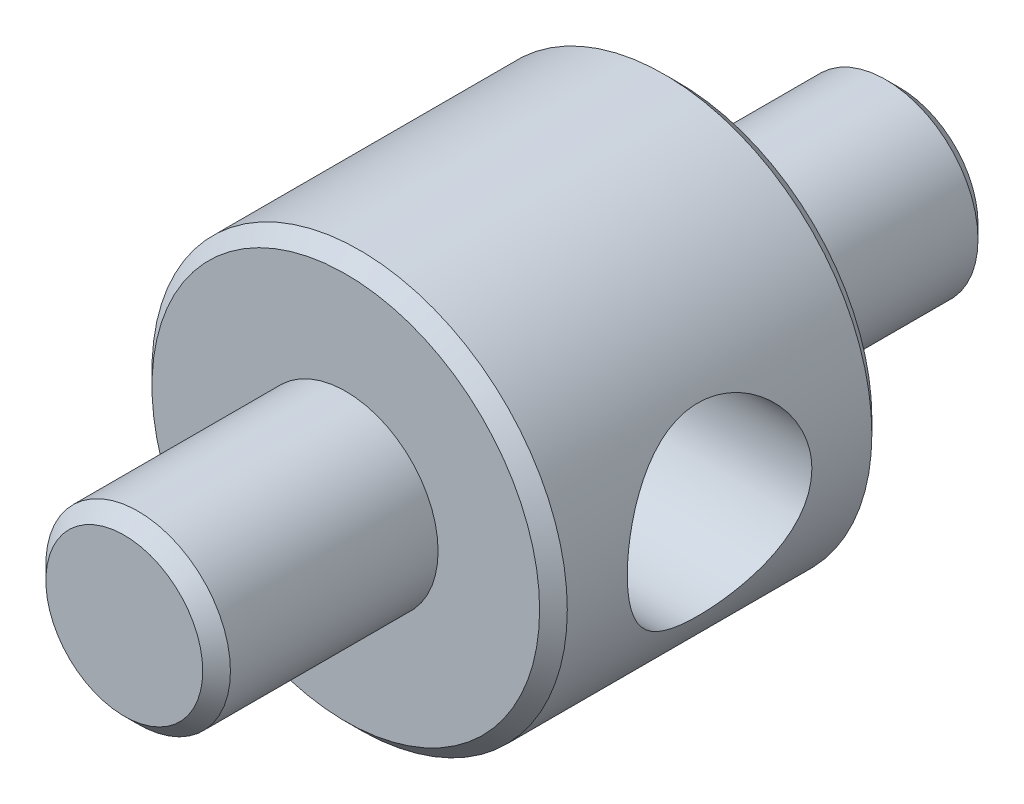
ISO-10303-21;
HEADER;
FILE_DESCRIPTION(('STEP AP214'),'2;1');
FILE_NAME('part.step','',(''),(''),'','','');
FILE_SCHEMA(('AUTOMOTIVE_DESIGN { 1 0 10303 214 1 1 1 1 }'));
ENDSEC;
DATA;
#1=APPLICATION_CONTEXT('core data for automotive mechanical design processes');
#2=APPLICATION_PROTOCOL_DEFINITION('international standard','automotive_design',2000,#1);
#3=PRODUCT_CONTEXT('',#1,'mechanical');
#4=PRODUCT('Part','Part','',(#3));
#5=PRODUCT_RELATED_PRODUCT_CATEGORY('part','',(#4));
#6=PRODUCT_DEFINITION_FORMATION('','',#4);
#7=PRODUCT_DEFINITION_CONTEXT('part definition',#1,'design');
#8=PRODUCT_DEFINITION('design','',#6,#7);
#9=PRODUCT_DEFINITION_SHAPE('','',#8);
#10=(LENGTH_UNIT() NAMED_UNIT(*) SI_UNIT(.MILLI.,.METRE.));
#11=(NAMED_UNIT(*) PLANE_ANGLE_UNIT() SI_UNIT($,.RADIAN.));
#12=(NAMED_UNIT(*) SI_UNIT($,.STERADIAN.) SOLID_ANGLE_UNIT());
#13=UNCERTAINTY_MEASURE_WITH_UNIT(LENGTH_MEASURE(1.E-05),#10,'distance_accuracy_value','');
#14=(GEOMETRIC_REPRESENTATION_CONTEXT(3) GLOBAL_UNCERTAINTY_ASSIGNED_CONTEXT((#13)) GLOBAL_UNIT_ASSIGNED_CONTEXT((#10,
#11,#12)) REPRESENTATION_CONTEXT('',''));
#15=CARTESIAN_POINT('',(0.,0.,0.));
#16=DIRECTION('',(0.,0.,1.));
#17=DIRECTION('',(1.,0.,0.));
#18=AXIS2_PLACEMENT_3D('',#15,#16,#17);
#19=CARTESIAN_POINT('',(0.,0.,18.));
#20=DIRECTION('',(0.,0.,-1.));
#21=DIRECTION('',(-1.,0.,0.));
#22=AXIS2_PLACEMENT_3D('',#19,#20,#21);
#23=CYLINDRICAL_SURFACE('',#22,22.5);
#24=CARTESIAN_POINT('',(-22.5,0.,-10.));
#25=CARTESIAN_POINT('',(-22.4999983412741,0.266358674506629,-9.99999801489142));
#26=CARTESIAN_POINT('',(-22.4952577550859,0.532785210886051,-9.98934407429766));
#27=CARTESIAN_POINT('',(-22.4764129887687,1.06372052827526,-9.94683332964316));
#28=CARTESIAN_POINT('',(-22.4623034599646,1.3282281265239,-9.91496441404969));
#29=CARTESIAN_POINT('',(-22.4250533191297,1.85378409880719,-9.83028307683902));
#30=CARTESIAN_POINT('',(-22.4018943007243,2.11482429416228,-9.77742796641402));
#31=CARTESIAN_POINT('',(-22.3471481148333,2.63103736565179,-9.65133414309113));
#32=CARTESIAN_POINT('',(-22.3155603486292,2.88620982358468,-9.57809398216803));
#33=CARTESIAN_POINT('',(-22.2448892220841,3.38804988474801,-9.41226320369187));
#34=CARTESIAN_POINT('',(-22.2058338172876,3.63474528214795,-9.31974464349954));
#35=CARTESIAN_POINT('',(-22.1211070120447,4.11911290035001,-9.11602719514624));
#36=CARTESIAN_POINT('',(-22.0754354056065,4.35678483992094,-9.00482772534838));
#37=CARTESIAN_POINT('',(-21.9785761888309,4.82167159326358,-8.76469499017571));
#38=CARTESIAN_POINT('',(-21.9273913187015,5.04889152249531,-8.63577052576966));
#39=CARTESIAN_POINT('',(-21.8206650853107,5.49186561087359,-8.36106562417567));
#40=CARTESIAN_POINT('',(-21.7651221240651,5.70761551519558,-8.21527899474929));
#41=CARTESIAN_POINT('',(-21.5880568498737,6.35714242369687,-7.73850030503356));
#42=CARTESIAN_POINT('',(-21.4611409325697,6.76979822740147,-7.38012792068984));
#43=CARTESIAN_POINT('',(-21.2058946147112,7.53139326958645,-6.60114247843569));
#44=CARTESIAN_POINT('',(-21.0775634189794,7.88029452728651,-6.18049258800698));
#45=CARTESIAN_POINT('',(-20.8904888985783,8.35877756226238,-5.49676219265885));
#46=CARTESIAN_POINT('',(-20.8274141488895,8.51431075280241,-5.25266913044278));
#47=CARTESIAN_POINT('',(-20.706580039709,8.80409930019552,-4.75096387485483));
#48=CARTESIAN_POINT('',(-20.6488184651489,8.93836354110986,-4.4933573862268));
#49=CARTESIAN_POINT('',(-20.5405571154436,9.184421545613,-3.96623247962893));
#50=CARTESIAN_POINT('',(-20.4900557283934,9.29622029918278,-3.69671672317797));
#51=CARTESIAN_POINT('',(-20.3981349149272,9.49622142398353,-3.14756074684072));
#52=CARTESIAN_POINT('',(-20.3567147069907,9.58442582587336,-2.86792140059931));
#53=CARTESIAN_POINT('',(-20.2864713022003,9.73218489954871,-2.3155897322206));
#54=CARTESIAN_POINT('',(-20.2571004246296,9.79300174905989,-2.04330481322032));
#55=CARTESIAN_POINT('',(-20.2090612627247,9.89175779481313,-1.4936771914048));
#56=CARTESIAN_POINT('',(-20.1903926080827,9.92969778262004,-1.21633466393058));
#57=CARTESIAN_POINT('',(-20.1644973394177,9.98217951008383,-0.659070013584596));
#58=CARTESIAN_POINT('',(-20.1572641728748,9.99673464930624,-0.37914946047934));
#59=CARTESIAN_POINT('',(-20.1545116933501,10.0022834901155,0.180974132128588));
#60=CARTESIAN_POINT('',(-20.1589916277639,9.993278705503,0.461177152325461));
#61=CARTESIAN_POINT('',(-20.178556996954,9.95370553775353,0.994311539194443));
#62=CARTESIAN_POINT('',(-20.1926536074241,9.92514683895553,1.24743167715935));
#63=CARTESIAN_POINT('',(-20.2299357176033,9.84893398121707,1.75018866603186));
#64=CARTESIAN_POINT('',(-20.2531243076265,9.80127332950511,1.99982430266817));
#65=CARTESIAN_POINT('',(-20.3078519348151,9.68736967775726,2.49381495021869));
#66=CARTESIAN_POINT('',(-20.3393891895847,9.62113064392871,2.73817107625066));
#67=CARTESIAN_POINT('',(-20.4098821228145,9.47067093458348,3.22027775721418));
#68=CARTESIAN_POINT('',(-20.4488407242047,9.38644317253835,3.45802566705101));
#69=CARTESIAN_POINT('',(-20.5339927684761,9.19869507343533,3.93065940340294));
#70=CARTESIAN_POINT('',(-20.5803264052518,9.09479139530678,4.16536747547223));
#71=CARTESIAN_POINT('',(-20.6783222006865,8.86972683399475,4.62531422771477));
#72=CARTESIAN_POINT('',(-20.7299866437201,8.74855854398004,4.85054878958468));
#73=CARTESIAN_POINT('',(-20.8372968943357,8.48979808494964,5.29041076733051));
#74=CARTESIAN_POINT('',(-20.8929431658974,8.35220400067697,5.50503694212868));
#75=CARTESIAN_POINT('',(-21.0068589492686,8.06140567885882,5.9227107488607));
#76=CARTESIAN_POINT('',(-21.0651286283891,7.90820044490401,6.12575764043459));
#77=CARTESIAN_POINT('',(-21.1887005762833,7.57127612315421,6.53861837350061));
#78=CARTESIAN_POINT('',(-21.254133812688,7.38603823151229,6.74715584420609));
#79=CARTESIAN_POINT('',(-21.3847641683632,6.99882808584691,7.14800953933823));
#80=CARTESIAN_POINT('',(-21.4499613534205,6.79686094083625,7.34033068019162));
#81=CARTESIAN_POINT('',(-21.5784874997096,6.37707504510995,7.70783899814699));
#82=CARTESIAN_POINT('',(-21.6418151491746,6.15924551934532,7.88301433543272));
#83=CARTESIAN_POINT('',(-21.7648901464863,5.709113060899,8.21487573203865));
#84=CARTESIAN_POINT('',(-21.8246389222671,5.47681597710945,8.37156918995315));
#85=CARTESIAN_POINT('',(-21.9407342792391,4.99181150591135,8.66978956457849));
#86=CARTESIAN_POINT('',(-21.9969259705791,4.73870176201838,8.81072380191943));
#87=CARTESIAN_POINT('',(-22.1022977955686,4.22000703014157,9.07059429202969));
#88=CARTESIAN_POINT('',(-22.1514777078841,3.95442164870328,9.18952985042368));
#89=CARTESIAN_POINT('',(-22.2413648148402,3.41277136658874,9.40413754279795));
#90=CARTESIAN_POINT('',(-22.2820763099849,3.13671186960291,9.49982148878462));
#91=CARTESIAN_POINT('',(-22.3538236970007,2.57611847726868,9.66690930787201));
#92=CARTESIAN_POINT('',(-22.3848604401935,2.2915853299672,9.73831531733953));
#93=CARTESIAN_POINT('',(-22.4344936419773,1.73655379186009,9.85184842232812));
#94=CARTESIAN_POINT('',(-22.4538085491568,1.46646625264617,9.89567445854468));
#95=CARTESIAN_POINT('',(-22.4827022481691,0.923093824753187,9.96106249991966));
#96=CARTESIAN_POINT('',(-22.492281491961,0.649809085093726,9.98262553859495));
#97=CARTESIAN_POINT('',(-22.5014327813663,0.102305199893459,10.0032275607149));
#98=CARTESIAN_POINT('',(-22.5010077394445,-0.171913650464062,10.0022730994924));
#99=CARTESIAN_POINT('',(-22.4901693364661,-0.719144891104904,9.97786740741689));
#100=CARTESIAN_POINT('',(-22.4797562573607,-0.992157315225745,9.95441681160476));
#101=CARTESIAN_POINT('',(-22.4501266532091,-1.5189915807864,9.88731655373121));
#102=CARTESIAN_POINT('',(-22.4314577903456,-1.77300551778789,9.84492197887201));
#103=CARTESIAN_POINT('',(-22.3859845778249,-2.2762980737003,9.74086726803527));
#104=CARTESIAN_POINT('',(-22.3591806218089,-2.52557692111295,9.6792080642313));
#105=CARTESIAN_POINT('',(-22.2980830127615,-3.0177798863728,9.53722228352212));
#106=CARTESIAN_POINT('',(-22.2637901456724,-3.26070466806966,9.45689766544831));
#107=CARTESIAN_POINT('',(-22.1884984795923,-3.7388693183974,9.27825549703403));
#108=CARTESIAN_POINT('',(-22.1474971105102,-3.97410620011853,9.17993104906421));
#109=CARTESIAN_POINT('',(-22.0583710838479,-4.4426193877379,8.96280280783393));
#110=CARTESIAN_POINT('',(-22.010065898814,-4.67561206078989,8.84346144460099));
#111=CARTESIAN_POINT('',(-21.908433598371,-5.13078390971223,8.58739045891613));
#112=CARTESIAN_POINT('',(-21.8551047719357,-5.35295936192739,8.4506549064971));
#113=CARTESIAN_POINT('',(-21.744642321343,-5.78535529571012,8.160725126261));
#114=CARTESIAN_POINT('',(-21.6875079761197,-5.99557349755944,8.00752777588658));
#115=CARTESIAN_POINT('',(-21.5707242991031,-6.40302886015366,7.68561275034613));
#116=CARTESIAN_POINT('',(-21.5110748459504,-6.60026539332612,7.51689432578923));
#117=CARTESIAN_POINT('',(-21.38572348661,-6.99623977160872,7.1506032700088));
#118=CARTESIAN_POINT('',(-21.3199221098287,-7.19381006998432,6.95180065996954));
#119=CARTESIAN_POINT('',(-21.1887052352925,-7.57157516822001,6.5383216067555));
#120=CARTESIAN_POINT('',(-21.1232896306177,-7.7517750176108,6.32364980895648));
#121=CARTESIAN_POINT('',(-20.9945797859484,-8.09388924179568,5.87942046829087));
#122=CARTESIAN_POINT('',(-20.9312865688396,-8.25579488629138,5.64985589991669));
#123=CARTESIAN_POINT('',(-20.8086644919195,-8.56016436228012,5.1771249604688));
#124=CARTESIAN_POINT('',(-20.7493361215173,-8.70262579589177,4.93395691700349));
#125=CARTESIAN_POINT('',(-20.6351213631842,-8.97014113507602,4.42944810766799));
#126=CARTESIAN_POINT('',(-20.5803743435446,-9.09469990199382,4.16781253194244));
#127=CARTESIAN_POINT('',(-20.4788579023647,-9.32103921932125,3.63350483395783));
#128=CARTESIAN_POINT('',(-20.4320847381341,-9.42283046316672,3.36083796423342));
#129=CARTESIAN_POINT('',(-20.3482468504859,-9.6025356438913,2.80645029954083));
#130=CARTESIAN_POINT('',(-20.3111766052706,-9.68046316559654,2.52473475698673));
#131=CARTESIAN_POINT('',(-20.2481926425272,-9.81152406599923,1.95437606654269));
#132=CARTESIAN_POINT('',(-20.222277664546,-9.86466024597034,1.66573370521908));
#133=CARTESIAN_POINT('',(-20.1843698111919,-9.94197643772676,1.10875008770604));
#134=CARTESIAN_POINT('',(-20.1713827745655,-9.96822966613534,0.840762703794265));
#135=CARTESIAN_POINT('',(-20.1561357409042,-9.99902478688881,0.303243244528133));
#136=CARTESIAN_POINT('',(-20.1538751110936,-10.0035679599608,0.0337112612325171));
#137=CARTESIAN_POINT('',(-20.1601645139545,-9.99088649900075,-0.5046580617197));
#138=CARTESIAN_POINT('',(-20.1687125217854,-9.9736659420863,-0.77349552203207));
#139=CARTESIAN_POINT('',(-20.196298945699,-9.91768517459673,-1.30836680601087));
#140=CARTESIAN_POINT('',(-20.2153371976009,-9.87892530112927,-1.57440067348938));
#141=CARTESIAN_POINT('',(-20.2617654840576,-9.78332716332782,-2.08566618198654));
#142=CARTESIAN_POINT('',(-20.2885807362236,-9.72772411668519,-2.33118280512387));
#143=CARTESIAN_POINT('',(-20.3500529208607,-9.59846160365254,-2.81649099138035));
#144=CARTESIAN_POINT('',(-20.3847125269139,-9.52479598029974,-3.05628057168104));
#145=CARTESIAN_POINT('',(-20.4608673563323,-9.36008167510315,-3.5286564779378));
#146=CARTESIAN_POINT('',(-20.5023616087251,-9.26903546216244,-3.76124382152048));
#147=CARTESIAN_POINT('',(-20.5910654560539,-9.07027346894596,-4.21808873074838));
#148=CARTESIAN_POINT('',(-20.6382771405329,-8.96255159020798,-4.44234321162513));
#149=CARTESIAN_POINT('',(-20.7930068459953,-8.60073036887333,-5.12891739777555));
#150=CARTESIAN_POINT('',(-20.9085624707511,-8.31840632323343,-5.5749207966406));
#151=CARTESIAN_POINT('',(-21.1482560424409,-7.68859265364666,-6.41574156812343));
#152=CARTESIAN_POINT('',(-21.2723975603181,-7.34107581132982,-6.8105374444338));
#153=CARTESIAN_POINT('',(-21.4615623012626,-6.7600210241619,-7.3745266720704));
#154=CARTESIAN_POINT('',(-21.5277465050087,-6.54670794344012,-7.56454357057132));
#155=CARTESIAN_POINT('',(-21.6573931597522,-6.10413045502065,-7.92597894664918));
#156=CARTESIAN_POINT('',(-21.7208564657984,-5.87487111875031,-8.09740329327397));
#157=CARTESIAN_POINT('',(-21.8433853752714,-5.40151273688932,-8.42056169047814));
#158=CARTESIAN_POINT('',(-21.9024477771704,-5.15740311817856,-8.57228146504076));
#159=CARTESIAN_POINT('',(-22.0144954122653,-4.65596026548334,-8.85464881838047));
#160=CARTESIAN_POINT('',(-22.0674811108367,-4.39862804632113,-8.98529801112928));
#161=CARTESIAN_POINT('',(-22.165327949851,-3.87534389039682,-9.22298029266647));
#162=CARTESIAN_POINT('',(-22.2102730712236,-3.60952001311623,-9.33026039701744));
#163=CARTESIAN_POINT('',(-22.2914633569308,-3.06846283264102,-9.52191574041082));
#164=CARTESIAN_POINT('',(-22.3277094716136,-2.79323056105034,-9.60629348162026));
#165=CARTESIAN_POINT('',(-22.3903507155281,-2.2361922261831,-9.75100247944083));
#166=CARTESIAN_POINT('',(-22.4167711762197,-1.95440508544985,-9.8113955983707));
#167=CARTESIAN_POINT('',(-22.4590737483085,-1.38603537042841,-9.90766770763661));
#168=CARTESIAN_POINT('',(-22.4749631808528,-1.09945626989597,-9.94356372881673));
#169=CARTESIAN_POINT('',(-22.4902249032581,-0.676807281399009,-9.97799030752754));
#170=CARTESIAN_POINT('',(-22.4938876174314,-0.541611708159812,-9.98624069441342));
#171=CARTESIAN_POINT('',(-22.4987756018156,-0.270949944583042,-9.99724607743069));
#172=CARTESIAN_POINT('',(-22.5000008437135,-0.135483751120323,-10.0000010097285));
#173=CARTESIAN_POINT('',(-22.5,0.,-10.));
#174=B_SPLINE_CURVE_WITH_KNOTS('',3,(#24,#25,#26,#27,#28,#29,#30,#31,#32,#33,#34,#35,#36,#37,
#38,#39,#40,#41,#42,#43,#44,#45,#46,#47,#48,#49,#50,#51,#52,#53,#54,#55,#56,#57,#58,#59,#60,#61,
#62,#63,#64,#65,#66,#67,#68,#69,#70,#71,#72,#73,#74,#75,#76,#77,#78,#79,#80,#81,#82,#83,#84,#85,
#86,#87,#88,#89,#90,#91,#92,#93,#94,#95,#96,#97,#98,#99,#100,#101,#102,#103,#104,#105,#106,#107,
#108,#109,#110,#111,#112,#113,#114,#115,#116,#117,#118,#119,#120,#121,#122,#123,#124,#125,#126,
#127,#128,#129,#130,#131,#132,#133,#134,#135,#136,#137,#138,#139,#140,#141,#142,#143,#144,#145,
#146,#147,#148,#149,#150,#151,#152,#153,#154,#155,#156,#157,#158,#159,#160,#161,#162,#163,#164,
#165,#166,#167,#168,#169,#170,#171,#172,#173),.UNSPECIFIED.,.T.,.F.,(4,2,2,2,2,2,2,2,2,2,2,2,2,
2,2,2,2,2,2,2,2,2,2,2,2,2,2,2,2,2,2,2,2,2,2,2,2,2,2,2,2,2,2,2,2,2,2,2,2,2,2,2,2,2,2,2,2,2,2,2,2,
2,2,2,2,2,2,2,2,2,2,2,2,2,4),(0.,0.798939988736112,1.59833648028421,2.39936745399693,
3.20045534241788,3.99860103417523,4.79677158109495,5.59454723518231,6.39261678960633,
8.06823192686051,9.74484205435457,10.6325756831291,11.5199375213358,12.4071020424309,
13.2941901847141,14.1346521822908,14.9750850972783,15.8150362705344,16.6549334755631,
17.4193840619599,18.1840947064805,18.9486422207896,19.713491480414,20.495151264384,
21.2771474099687,22.0592348259744,22.8413721914028,23.6999091725122,24.5581849215304,
25.4170492213531,26.2755685285795,27.1597265650926,28.0439125047716,28.9276483274309,
29.811306364534,30.6331401318182,31.4549357453345,32.2764921192689,33.0980253022626,
33.8717427906967,34.6454228464181,35.4190217453607,36.1929177143791,36.990654006547,
37.7886629927483,38.5868236174462,39.3850227993026,40.2477471216788,41.1102198918944,
41.9731025254806,42.8360914747369,43.7196246852545,44.6027420429537,45.4853557326304,
46.3678696680602,47.1755535918615,47.9831898679062,48.7906748674939,49.5981472296472,
50.3567815506315,51.1156748265053,51.874460382119,52.6335240918381,54.2474381734601,
55.8620275792542,56.7408578711325,57.6194099332247,58.4985949995076,59.377712689651,
60.2470308231936,61.1162539422829,61.9832203267677,62.8495833641855,63.2559607029152,
63.6623427619733),.UNSPECIFIED.);
#175=CARTESIAN_POINT('',(-22.5,0.,-10.));
#176=VERTEX_POINT('',#175);
#177=EDGE_CURVE('E67',#176,#176,#174,.T.);
#178=ORIENTED_EDGE('',*,*,#177,.T.);
#179=EDGE_LOOP('',(#178));
#180=FACE_BOUND('',#179,.T.);
#181=CARTESIAN_POINT('',(22.5,0.,-10.));
#182=CARTESIAN_POINT('',(22.4999983412741,-0.266358674506631,-9.99999801489142));
#183=CARTESIAN_POINT('',(22.4952577550859,-0.532785210886055,-9.98934407429766));
#184=CARTESIAN_POINT('',(22.4764129887687,-1.06372052827527,-9.94683332964316));
#185=CARTESIAN_POINT('',(22.4623034599646,-1.3282281265239,-9.91496441404969));
#186=CARTESIAN_POINT('',(22.4250533191297,-1.8537840988072,-9.83028307683902));
#187=CARTESIAN_POINT('',(22.4018943007243,-2.11482429416229,-9.77742796641402));
#188=CARTESIAN_POINT('',(22.3471481148333,-2.63103736565179,-9.65133414309113));
#189=CARTESIAN_POINT('',(22.3155603486292,-2.88620982358468,-9.57809398216803));
#190=CARTESIAN_POINT('',(22.2448892220841,-3.38804988474801,-9.41226320369187));
#191=CARTESIAN_POINT('',(22.2058338172876,-3.63474528214795,-9.31974464349954));
#192=CARTESIAN_POINT('',(22.1211070120447,-4.11911290035001,-9.11602719514624));
#193=CARTESIAN_POINT('',(22.0754354056065,-4.35678483992094,-9.00482772534838));
#194=CARTESIAN_POINT('',(21.9785761888309,-4.82167159326358,-8.76469499017571));
#195=CARTESIAN_POINT('',(21.9273913187015,-5.04889152249532,-8.63577052576966));
#196=CARTESIAN_POINT('',(21.8206650853107,-5.49186561087359,-8.36106562417567));
#197=CARTESIAN_POINT('',(21.7651221240651,-5.70761551519558,-8.21527899474929));
#198=CARTESIAN_POINT('',(21.5880568498737,-6.35714242369687,-7.73850030503356));
#199=CARTESIAN_POINT('',(21.4611409325697,-6.76979822740148,-7.38012792068984));
#200=CARTESIAN_POINT('',(21.2058946147112,-7.53139326958646,-6.60114247843568));
#201=CARTESIAN_POINT('',(21.0775634189794,-7.88029452728653,-6.18049258800698));
#202=CARTESIAN_POINT('',(20.8904888985783,-8.35877756226239,-5.49676219265884));
#203=CARTESIAN_POINT('',(20.8274141488895,-8.51431075280241,-5.25266913044277));
#204=CARTESIAN_POINT('',(20.706580039709,-8.80409930019552,-4.75096387485482));
#205=CARTESIAN_POINT('',(20.6488184651489,-8.93836354110986,-4.49335738622679));
#206=CARTESIAN_POINT('',(20.5405571154436,-9.18442154561301,-3.96623247962893));
#207=CARTESIAN_POINT('',(20.4900557283934,-9.29622029918278,-3.69671672317796));
#208=CARTESIAN_POINT('',(20.3981349149272,-9.49622142398353,-3.14756074684071));
#209=CARTESIAN_POINT('',(20.3567147069907,-9.58442582587336,-2.86792140059931));
#210=CARTESIAN_POINT('',(20.2864713022003,-9.73218489954871,-2.3155897322206));
#211=CARTESIAN_POINT('',(20.2571004246296,-9.79300174905989,-2.04330481322031));
#212=CARTESIAN_POINT('',(20.2090612627247,-9.89175779481313,-1.4936771914048));
#213=CARTESIAN_POINT('',(20.1903926080827,-9.92969778262004,-1.21633466393058));
#214=CARTESIAN_POINT('',(20.1644973394177,-9.98217951008384,-0.65907001358459));
#215=CARTESIAN_POINT('',(20.1572641728748,-9.99673464930624,-0.379149460479334));
#216=CARTESIAN_POINT('',(20.1545116933501,-10.0022834901155,0.180974132128594));
#217=CARTESIAN_POINT('',(20.1589916277639,-9.99327870550299,0.461177152325467));
#218=CARTESIAN_POINT('',(20.178556996954,-9.95370553775352,0.99431153919445));
#219=CARTESIAN_POINT('',(20.1926536074241,-9.92514683895552,1.24743167715936));
#220=CARTESIAN_POINT('',(20.2299357176033,-9.84893398121707,1.75018866603187));
#221=CARTESIAN_POINT('',(20.2531243076265,-9.80127332950511,1.99982430266817));
#222=CARTESIAN_POINT('',(20.3078519348151,-9.68736967775726,2.49381495021869));
#223=CARTESIAN_POINT('',(20.3393891895847,-9.62113064392871,2.73817107625067));
#224=CARTESIAN_POINT('',(20.4098821228145,-9.47067093458347,3.22027775721419));
#225=CARTESIAN_POINT('',(20.4488407242047,-9.38644317253833,3.45802566705101));
#226=CARTESIAN_POINT('',(20.5339927684761,-9.19869507343532,3.93065940340295));
#227=CARTESIAN_POINT('',(20.5803264052518,-9.09479139530677,4.16536747547223));
#228=CARTESIAN_POINT('',(20.6783222006865,-8.86972683399475,4.62531422771478));
#229=CARTESIAN_POINT('',(20.7299866437201,-8.74855854398003,4.85054878958469));
#230=CARTESIAN_POINT('',(20.8372968943357,-8.48979808494964,5.29041076733051));
#231=CARTESIAN_POINT('',(20.8929431658974,-8.35220400067697,5.50503694212868));
#232=CARTESIAN_POINT('',(21.0068589492686,-8.06140567885882,5.92271074886071));
#233=CARTESIAN_POINT('',(21.0651286283891,-7.90820044490401,6.12575764043459));
#234=CARTESIAN_POINT('',(21.1887005762833,-7.57127612315421,6.53861837350061));
#235=CARTESIAN_POINT('',(21.254133812688,-7.38603823151229,6.74715584420609));
#236=CARTESIAN_POINT('',(21.3847641683632,-6.99882808584691,7.14800953933823));
#237=CARTESIAN_POINT('',(21.4499613534205,-6.79686094083624,7.34033068019162));
#238=CARTESIAN_POINT('',(21.5784874997096,-6.37707504510995,7.70783899814699));
#239=CARTESIAN_POINT('',(21.6418151491746,-6.15924551934532,7.88301433543273));
#240=CARTESIAN_POINT('',(21.7648901464863,-5.709113060899,8.21487573203865));
#241=CARTESIAN_POINT('',(21.8246389222671,-5.47681597710945,8.37156918995315));
#242=CARTESIAN_POINT('',(21.9407342792391,-4.99181150591135,8.66978956457849));
#243=CARTESIAN_POINT('',(21.9969259705791,-4.73870176201838,8.81072380191944));
#244=CARTESIAN_POINT('',(22.1022977955686,-4.22000703014157,9.07059429202969));
#245=CARTESIAN_POINT('',(22.1514777078841,-3.95442164870328,9.18952985042368));
#246=CARTESIAN_POINT('',(22.2413648148402,-3.41277136658874,9.40413754279795));
#247=CARTESIAN_POINT('',(22.2820763099849,-3.13671186960291,9.49982148878462));
#248=CARTESIAN_POINT('',(22.3538236970007,-2.57611847726868,9.66690930787201));
#249=CARTESIAN_POINT('',(22.3848604401935,-2.2915853299672,9.73831531733953));
#250=CARTESIAN_POINT('',(22.4344936419773,-1.73655379186009,9.85184842232812));
#251=CARTESIAN_POINT('',(22.4538085491568,-1.46646625264617,9.89567445854468));
#252=CARTESIAN_POINT('',(22.4827022481691,-0.923093824753189,9.96106249991967));
#253=CARTESIAN_POINT('',(22.492281491961,-0.649809085093728,9.98262553859495));
#254=CARTESIAN_POINT('',(22.5014327813663,-0.102305199893463,10.0032275607149));
#255=CARTESIAN_POINT('',(22.5010077394445,0.171913650464058,10.0022730994924));
#256=CARTESIAN_POINT('',(22.4901693364661,0.719144891104901,9.97786740741689));
#257=CARTESIAN_POINT('',(22.4797562573607,0.992157315225743,9.95441681160476));
#258=CARTESIAN_POINT('',(22.4501266532091,1.5189915807864,9.88731655373121));
#259=CARTESIAN_POINT('',(22.4314577903456,1.77300551778789,9.84492197887201));
#260=CARTESIAN_POINT('',(22.3859845778249,2.27629807370031,9.74086726803527));
#261=CARTESIAN_POINT('',(22.3591806218089,2.52557692111296,9.6792080642313));
#262=CARTESIAN_POINT('',(22.2980830127615,3.01777988637281,9.53722228352212));
#263=CARTESIAN_POINT('',(22.2637901456724,3.26070466806968,9.4568976654483));
#264=CARTESIAN_POINT('',(22.1884984795923,3.73886931839742,9.27825549703403));
#265=CARTESIAN_POINT('',(22.1474971105102,3.97410620011856,9.1799310490642));
#266=CARTESIAN_POINT('',(22.0583710838479,4.44261938773793,8.96280280783393));
#267=CARTESIAN_POINT('',(22.010065898814,4.67561206078991,8.84346144460098));
#268=CARTESIAN_POINT('',(21.908433598371,5.13078390971224,8.58739045891612));
#269=CARTESIAN_POINT('',(21.8551047719357,5.35295936192741,8.45065490649709));
#270=CARTESIAN_POINT('',(21.744642321343,5.78535529571014,8.16072512626099));
#271=CARTESIAN_POINT('',(21.6875079761196,5.99557349755945,8.00752777588657));
#272=CARTESIAN_POINT('',(21.5707242991031,6.40302886015366,7.68561275034612));
#273=CARTESIAN_POINT('',(21.5110748459504,6.60026539332612,7.51689432578922));
#274=CARTESIAN_POINT('',(21.38572348661,6.99623977160872,7.15060327000879));
#275=CARTESIAN_POINT('',(21.3199221098287,7.19381006998432,6.95180065996953));
#276=CARTESIAN_POINT('',(21.1887052352925,7.57157516822002,6.5383216067555));
#277=CARTESIAN_POINT('',(21.1232896306177,7.7517750176108,6.32364980895648));
#278=CARTESIAN_POINT('',(20.9945797859484,8.09388924179569,5.87942046829086));
#279=CARTESIAN_POINT('',(20.9312865688396,8.25579488629139,5.64985589991669));
#280=CARTESIAN_POINT('',(20.8086644919195,8.56016436228012,5.17712496046879));
#281=CARTESIAN_POINT('',(20.7493361215173,8.70262579589177,4.93395691700348));
#282=CARTESIAN_POINT('',(20.6351213631842,8.97014113507602,4.42944810766798));
#283=CARTESIAN_POINT('',(20.5803743435446,9.09469990199382,4.16781253194243));
#284=CARTESIAN_POINT('',(20.4788579023647,9.32103921932126,3.63350483395782));
#285=CARTESIAN_POINT('',(20.4320847381341,9.42283046316673,3.3608379642334));
#286=CARTESIAN_POINT('',(20.3482468504859,9.60253564389131,2.80645029954081));
#287=CARTESIAN_POINT('',(20.3111766052706,9.68046316559655,2.52473475698672));
#288=CARTESIAN_POINT('',(20.2481926425272,9.81152406599923,1.95437606654268));
#289=CARTESIAN_POINT('',(20.222277664546,9.86466024597034,1.66573370521907));
#290=CARTESIAN_POINT('',(20.1843698111919,9.94197643772676,1.10875008770603));
#291=CARTESIAN_POINT('',(20.1713827745655,9.96822966613534,0.840762703794257));
#292=CARTESIAN_POINT('',(20.1561357409042,9.99902478688881,0.303243244528124));
#293=CARTESIAN_POINT('',(20.1538751110936,10.0035679599608,0.0337112612325072));
#294=CARTESIAN_POINT('',(20.1601645139545,9.99088649900075,-0.50465806171971));
#295=CARTESIAN_POINT('',(20.1687125217854,9.9736659420863,-0.773495522032078));
#296=CARTESIAN_POINT('',(20.196298945699,9.91768517459673,-1.30836680601087));
#297=CARTESIAN_POINT('',(20.2153371976009,9.87892530112926,-1.57440067348939));
#298=CARTESIAN_POINT('',(20.2617654840576,9.78332716332781,-2.08566618198654));
#299=CARTESIAN_POINT('',(20.2885807362236,9.72772411668519,-2.33118280512388));
#300=CARTESIAN_POINT('',(20.3500529208607,9.59846160365254,-2.81649099138036));
#301=CARTESIAN_POINT('',(20.3847125269139,9.52479598029974,-3.05628057168105));
#302=CARTESIAN_POINT('',(20.4608673563323,9.36008167510314,-3.52865647793781));
#303=CARTESIAN_POINT('',(20.5023616087251,9.26903546216244,-3.76124382152049));
#304=CARTESIAN_POINT('',(20.5910654560539,9.07027346894596,-4.21808873074838));
#305=CARTESIAN_POINT('',(20.6382771405329,8.96255159020798,-4.44234321162514));
#306=CARTESIAN_POINT('',(20.7930068459953,8.60073036887333,-5.12891739777556));
#307=CARTESIAN_POINT('',(20.9085624707511,8.31840632323342,-5.5749207966406));
#308=CARTESIAN_POINT('',(21.1482560424409,7.68859265364665,-6.41574156812343));
#309=CARTESIAN_POINT('',(21.2723975603181,7.34107581132982,-6.81053744443381));
#310=CARTESIAN_POINT('',(21.4615623012626,6.7600210241619,-7.3745266720704));
#311=CARTESIAN_POINT('',(21.5277465050087,6.54670794344012,-7.56454357057132));
#312=CARTESIAN_POINT('',(21.6573931597522,6.10413045502064,-7.92597894664919));
#313=CARTESIAN_POINT('',(21.7208564657984,5.87487111875031,-8.09740329327398));
#314=CARTESIAN_POINT('',(21.8433853752714,5.40151273688932,-8.42056169047814));
#315=CARTESIAN_POINT('',(21.9024477771704,5.15740311817856,-8.57228146504076));
#316=CARTESIAN_POINT('',(22.0144954122653,4.65596026548333,-8.85464881838047));
#317=CARTESIAN_POINT('',(22.0674811108367,4.39862804632113,-8.98529801112928));
#318=CARTESIAN_POINT('',(22.165327949851,3.87534389039682,-9.22298029266647));
#319=CARTESIAN_POINT('',(22.2102730712236,3.60952001311623,-9.33026039701744));
#320=CARTESIAN_POINT('',(22.2914633569308,3.06846283264102,-9.52191574041082));
#321=CARTESIAN_POINT('',(22.3277094716136,2.79323056105034,-9.60629348162026));
#322=CARTESIAN_POINT('',(22.3903507155281,2.2361922261831,-9.75100247944083));
#323=CARTESIAN_POINT('',(22.4167711762197,1.95440508544985,-9.8113955983707));
#324=CARTESIAN_POINT('',(22.4590737483085,1.38603537042841,-9.90766770763661));
#325=CARTESIAN_POINT('',(22.4749631808527,1.09945626989597,-9.94356372881673));
#326=CARTESIAN_POINT('',(22.4902249032581,0.676807281399004,-9.97799030752754));
#327=CARTESIAN_POINT('',(22.4938876174314,0.541611708159803,-9.98624069441342));
#328=CARTESIAN_POINT('',(22.4987756018156,0.270949944583034,-9.99724607743069));
#329=CARTESIAN_POINT('',(22.5000008437135,0.135483751120319,-10.0000010097285));
#330=CARTESIAN_POINT('',(22.5,0.,-10.));
#331=B_SPLINE_CURVE_WITH_KNOTS('',3,(#181,#182,#183,#184,#185,#186,#187,#188,#189,#190,#191,
#192,#193,#194,#195,#196,#197,#198,#199,#200,#201,#202,#203,#204,#205,#206,#207,#208,#209,#210,
#211,#212,#213,#214,#215,#216,#217,#218,#219,#220,#221,#222,#223,#224,#225,#226,#227,#228,#229,
#230,#231,#232,#233,#234,#235,#236,#237,#238,#239,#240,#241,#242,#243,#244,#245,#246,#247,#248,
#249,#250,#251,#252,#253,#254,#255,#256,#257,#258,#259,#260,#261,#262,#263,#264,#265,#266,#267,
#268,#269,#270,#271,#272,#273,#274,#275,#276,#277,#278,#279,#280,#281,#282,#283,#284,#285,#286,
#287,#288,#289,#290,#291,#292,#293,#294,#295,#296,#297,#298,#299,#300,#301,#302,#303,#304,#305,
#306,#307,#308,#309,#310,#311,#312,#313,#314,#315,#316,#317,#318,#319,#320,#321,#322,#323,#324,
#325,#326,#327,#328,#329,#330),.UNSPECIFIED.,.T.,.F.,(4,2,2,2,2,2,2,2,2,2,2,2,2,2,2,2,2,2,2,2,2,
2,2,2,2,2,2,2,2,2,2,2,2,2,2,2,2,2,2,2,2,2,2,2,2,2,2,2,2,2,2,2,2,2,2,2,2,2,2,2,2,2,2,2,2,2,2,2,2,
2,2,2,2,2,4),(0.,0.798939988736116,1.59833648028422,2.39936745399693,3.20045534241788,
3.99860103417523,4.79677158109495,5.59454723518231,6.39261678960633,8.06823192686052,
9.74484205435458,10.6325756831291,11.5199375213358,12.4071020424309,13.2941901847141,
14.1346521822908,14.9750850972784,15.8150362705344,16.6549334755631,17.4193840619599,
18.1840947064805,18.9486422207896,19.713491480414,20.495151264384,21.2771474099687,
22.0592348259744,22.8413721914028,23.6999091725123,24.5581849215304,25.4170492213531,
26.2755685285795,27.1597265650926,28.0439125047716,28.9276483274309,29.811306364534,
30.6331401318182,31.4549357453345,32.2764921192689,33.0980253022627,33.8717427906967,
34.6454228464181,35.4190217453608,36.1929177143792,36.9906540065471,37.7886629927483,
38.5868236174462,39.3850227993026,40.2477471216788,41.1102198918945,41.9731025254806,
42.836091474737,43.7196246852545,44.6027420429537,45.4853557326304,46.3678696680602,
47.1755535918615,47.9831898679063,48.790674867494,49.5981472296473,50.3567815506315,
51.1156748265053,51.874460382119,52.6335240918381,54.2474381734601,55.8620275792542,
56.7408578711325,57.6194099332247,58.4985949995076,59.377712689651,60.2470308231936,
61.1162539422829,61.9832203267678,62.8495833641855,63.2559607029152,63.6623427619733),.UNSPECIFIED.);
#332=CARTESIAN_POINT('',(22.5,0.,-10.));
#333=VERTEX_POINT('',#332);
#334=EDGE_CURVE('E76',#333,#333,#331,.T.);
#335=ORIENTED_EDGE('',*,*,#334,.T.);
#336=EDGE_LOOP('',(#335));
#337=FACE_BOUND('',#336,.T.);
#338=CARTESIAN_POINT('',(0.,0.,-16.5));
#339=DIRECTION('',(0.,0.,1.));
#340=DIRECTION('',(1.,0.,0.));
#341=AXIS2_PLACEMENT_3D('',#338,#339,#340);
#342=CIRCLE('',#341,22.5);
#343=CARTESIAN_POINT('',(22.5,0.,-16.5));
#344=VERTEX_POINT('',#343);
#345=EDGE_CURVE('E30',#344,#344,#342,.T.);
#346=ORIENTED_EDGE('',*,*,#345,.T.);
#347=EDGE_LOOP('',(#346));
#348=FACE_BOUND('',#347,.T.);
#349=CARTESIAN_POINT('',(0.,0.,16.5));
#350=DIRECTION('',(0.,0.,1.));
#351=DIRECTION('',(1.,0.,0.));
#352=AXIS2_PLACEMENT_3D('',#349,#350,#351);
#353=CIRCLE('',#352,22.5);
#354=CARTESIAN_POINT('',(22.5,0.,16.5));
#355=VERTEX_POINT('',#354);
#356=EDGE_CURVE('E37',#355,#355,#353,.F.);
#357=ORIENTED_EDGE('',*,*,#356,.T.);
#358=EDGE_LOOP('',(#357));
#359=FACE_BOUND('',#358,.T.);
#360=ADVANCED_FACE('F14',(#180,#337,#348,#359),#23,.T.);
#361=CARTESIAN_POINT('',(0.,0.,18.));
#362=DIRECTION('',(0.,0.,1.));
#363=DIRECTION('',(1.,0.,0.));
#364=AXIS2_PLACEMENT_3D('',#361,#362,#363);
#365=PLANE('',#364);
#366=CARTESIAN_POINT('',(0.,0.,18.));
#367=DIRECTION('',(0.,0.,1.));
#368=DIRECTION('',(1.,0.,0.));
#369=AXIS2_PLACEMENT_3D('',#366,#367,#368);
#370=CIRCLE('',#369,21.);
#371=CARTESIAN_POINT('',(21.,0.,18.));
#372=VERTEX_POINT('',#371);
#373=EDGE_CURVE('E9',#372,#372,#370,.T.);
#374=ORIENTED_EDGE('',*,*,#373,.T.);
#375=EDGE_LOOP('',(#374));
#376=FACE_BOUND('',#375,.T.);
#377=CARTESIAN_POINT('',(0.,0.,18.));
#378=DIRECTION('',(0.,0.,1.));
#379=DIRECTION('',(1.,0.,0.));
#380=AXIS2_PLACEMENT_3D('',#377,#378,#379);
#381=CIRCLE('',#380,10.);
#382=CARTESIAN_POINT('',(10.,0.,18.));
#383=VERTEX_POINT('',#382);
#384=EDGE_CURVE('E63',#383,#383,#381,.F.);
#385=ORIENTED_EDGE('',*,*,#384,.T.);
#386=EDGE_LOOP('',(#385));
#387=FACE_BOUND('',#386,.T.);
#388=ADVANCED_FACE('F96',(#376,#387),#365,.T.);
#389=CARTESIAN_POINT('',(0.,0.,-18.));
#390=DIRECTION('',(0.,0.,1.));
#391=DIRECTION('',(1.,0.,0.));
#392=AXIS2_PLACEMENT_3D('',#389,#390,#391);
#393=PLANE('',#392);
#394=CARTESIAN_POINT('',(0.,0.,-18.));
#395=DIRECTION('',(0.,0.,1.));
#396=DIRECTION('',(1.,0.,0.));
#397=AXIS2_PLACEMENT_3D('',#394,#395,#396);
#398=CIRCLE('',#397,21.);
#399=CARTESIAN_POINT('',(21.,0.,-18.));
#400=VERTEX_POINT('',#399);
#401=EDGE_CURVE('E22',#400,#400,#398,.F.);
#402=ORIENTED_EDGE('',*,*,#401,.T.);
#403=EDGE_LOOP('',(#402));
#404=FACE_BOUND('',#403,.T.);
#405=CARTESIAN_POINT('',(0.,0.,-18.));
#406=DIRECTION('',(0.,0.,1.));
#407=DIRECTION('',(1.,0.,0.));
#408=AXIS2_PLACEMENT_3D('',#405,#406,#407);
#409=CIRCLE('',#408,10.);
#410=CARTESIAN_POINT('',(10.,0.,-18.));
#411=VERTEX_POINT('',#410);
#412=EDGE_CURVE('E59',#411,#411,#409,.F.);
#413=ORIENTED_EDGE('',*,*,#412,.F.);
#414=EDGE_LOOP('',(#413));
#415=FACE_BOUND('',#414,.T.);
#416=ADVANCED_FACE('F102',(#404,#415),#393,.F.);
#417=CARTESIAN_POINT('',(0.,0.,-42.));
#418=DIRECTION('',(0.,0.,1.));
#419=DIRECTION('',(1.,0.,0.));
#420=AXIS2_PLACEMENT_3D('',#417,#418,#419);
#421=PLANE('',#420);
#422=CARTESIAN_POINT('',(0.,0.,-42.));
#423=DIRECTION('',(0.,0.,1.));
#424=DIRECTION('',(1.,0.,0.));
#425=AXIS2_PLACEMENT_3D('',#422,#423,#424);
#426=CIRCLE('',#425,8.49999999999996);
#427=CARTESIAN_POINT('',(8.49999999999996,0.,-42.));
#428=VERTEX_POINT('',#427);
#429=EDGE_CURVE('E43',#428,#428,#426,.F.);
#430=ORIENTED_EDGE('',*,*,#429,.T.);
#431=EDGE_LOOP('',(#430));
#432=FACE_BOUND('',#431,.T.);
#433=ADVANCED_FACE('F161',(#432),#421,.F.);
#434=CARTESIAN_POINT('',(0.,0.,42.));
#435=DIRECTION('',(0.,0.,-1.));
#436=DIRECTION('',(-1.,0.,0.));
#437=AXIS2_PLACEMENT_3D('',#434,#435,#436);
#438=CYLINDRICAL_SURFACE('',#437,10.);
#439=CARTESIAN_POINT('',(0.,0.,-40.5));
#440=DIRECTION('',(0.,0.,1.));
#441=DIRECTION('',(1.,0.,0.));
#442=AXIS2_PLACEMENT_3D('',#439,#440,#441);
#443=CIRCLE('',#442,10.);
#444=CARTESIAN_POINT('',(10.,0.,-40.5));
#445=VERTEX_POINT('',#444);
#446=EDGE_CURVE('E47',#445,#445,#443,.T.);
#447=ORIENTED_EDGE('',*,*,#446,.T.);
#448=EDGE_LOOP('',(#447));
#449=FACE_BOUND('',#448,.T.);
#450=ORIENTED_EDGE('',*,*,#412,.T.);
#451=EDGE_LOOP('',(#450));
#452=FACE_BOUND('',#451,.T.);
#453=ADVANCED_FACE('F170',(#449,#452),#438,.T.);
#454=CARTESIAN_POINT('',(0.,0.,40.5));
#455=DIRECTION('',(0.,0.,1.));
#456=DIRECTION('',(1.,0.,0.));
#457=AXIS2_PLACEMENT_3D('',#454,#455,#456);
#458=CIRCLE('',#457,10.);
#459=CARTESIAN_POINT('',(10.,0.,40.5));
#460=VERTEX_POINT('',#459);
#461=EDGE_CURVE('E51',#460,#460,#458,.F.);
#462=ORIENTED_EDGE('',*,*,#461,.T.);
#463=EDGE_LOOP('',(#462));
#464=FACE_BOUND('',#463,.T.);
#465=ORIENTED_EDGE('',*,*,#384,.F.);
#466=EDGE_LOOP('',(#465));
#467=FACE_BOUND('',#466,.T.);
#468=ADVANCED_FACE('F180',(#464,#467),#438,.T.);
#469=CARTESIAN_POINT('',(0.,0.,42.));
#470=DIRECTION('',(0.,0.,1.));
#471=DIRECTION('',(1.,0.,0.));
#472=AXIS2_PLACEMENT_3D('',#469,#470,#471);
#473=PLANE('',#472);
#474=CARTESIAN_POINT('',(0.,0.,42.));
#475=DIRECTION('',(0.,0.,1.));
#476=DIRECTION('',(1.,0.,0.));
#477=AXIS2_PLACEMENT_3D('',#474,#475,#476);
#478=CIRCLE('',#477,8.50000000000005);
#479=CARTESIAN_POINT('',(8.50000000000005,0.,42.));
#480=VERTEX_POINT('',#479);
#481=EDGE_CURVE('E55',#480,#480,#478,.T.);
#482=ORIENTED_EDGE('',*,*,#481,.T.);
#483=EDGE_LOOP('',(#482));
#484=FACE_BOUND('',#483,.T.);
#485=ADVANCED_FACE('F111',(#484),#473,.T.);
#486=CARTESIAN_POINT('',(0.,0.,42.));
#487=DIRECTION('',(0.,0.,-1.));
#488=DIRECTION('',(-1.,0.,0.));
#489=AXIS2_PLACEMENT_3D('',#486,#487,#488);
#490=CONICAL_SURFACE('',#489,8.50000000000005,0.785398163397445);
#491=ORIENTED_EDGE('',*,*,#461,.F.);
#492=EDGE_LOOP('',(#491));
#493=FACE_BOUND('',#492,.T.);
#494=ORIENTED_EDGE('',*,*,#481,.F.);
#495=EDGE_LOOP('',(#494));
#496=FACE_BOUND('',#495,.T.);
#497=ADVANCED_FACE('F107',(#493,#496),#490,.T.);
#498=CARTESIAN_POINT('',(0.,0.,-40.5));
#499=DIRECTION('',(0.,0.,1.));
#500=DIRECTION('',(1.,0.,0.));
#501=AXIS2_PLACEMENT_3D('',#498,#499,#500);
#502=CONICAL_SURFACE('',#501,10.,0.78539816339745);
#503=ORIENTED_EDGE('',*,*,#429,.F.);
#504=EDGE_LOOP('',(#503));
#505=FACE_BOUND('',#504,.T.);
#506=ORIENTED_EDGE('',*,*,#446,.F.);
#507=EDGE_LOOP('',(#506));
#508=FACE_BOUND('',#507,.T.);
#509=ADVANCED_FACE('F110',(#505,#508),#502,.T.);
#510=CARTESIAN_POINT('',(0.,0.,-16.5));
#511=DIRECTION('',(0.,0.,1.));
#512=DIRECTION('',(1.,0.,0.));
#513=AXIS2_PLACEMENT_3D('',#510,#511,#512);
#514=CONICAL_SURFACE('',#513,22.5,0.785398163397453);
#515=ORIENTED_EDGE('',*,*,#401,.F.);
#516=EDGE_LOOP('',(#515));
#517=FACE_BOUND('',#516,.T.);
#518=ORIENTED_EDGE('',*,*,#345,.F.);
#519=EDGE_LOOP('',(#518));
#520=FACE_BOUND('',#519,.T.);
#521=ADVANCED_FACE('F91',(#517,#520),#514,.T.);
#522=CARTESIAN_POINT('',(0.,0.,18.));
#523=DIRECTION('',(0.,0.,-1.));
#524=DIRECTION('',(-1.,0.,0.));
#525=AXIS2_PLACEMENT_3D('',#522,#523,#524);
#526=CONICAL_SURFACE('',#525,21.,0.785398163397447);
#527=ORIENTED_EDGE('',*,*,#356,.F.);
#528=EDGE_LOOP('',(#527));
#529=FACE_BOUND('',#528,.T.);
#530=ORIENTED_EDGE('',*,*,#373,.F.);
#531=EDGE_LOOP('',(#530));
#532=FACE_BOUND('',#531,.T.);
#533=ADVANCED_FACE('F16',(#529,#532),#526,.T.);
#534=CARTESIAN_POINT('',(-22.5,0.,0.));
#535=DIRECTION('',(1.,0.,0.));
#536=DIRECTION('',(0.,0.,-1.));
#537=AXIS2_PLACEMENT_3D('',#534,#535,#536);
#538=CYLINDRICAL_SURFACE('',#537,10.);
#539=ORIENTED_EDGE('',*,*,#334,.F.);
#540=EDGE_LOOP('',(#539));
#541=FACE_BOUND('',#540,.T.);
#542=ORIENTED_EDGE('',*,*,#177,.F.);
#543=EDGE_LOOP('',(#542));
#544=FACE_BOUND('',#543,.T.);
#545=ADVANCED_FACE('F82',(#541,#544),#538,.F.);
#546=CLOSED_SHELL('',(#360,#388,#416,#433,#453,#468,#485,#497,#509,#521,#533,#545));
#547=MANIFOLD_SOLID_BREP('B1',#546);
#548=ADVANCED_BREP_SHAPE_REPRESENTATION('',(#18,#547),#14);
#549=SHAPE_DEFINITION_REPRESENTATION(#9,#548);
ENDSEC;
END-ISO-10303-21;
